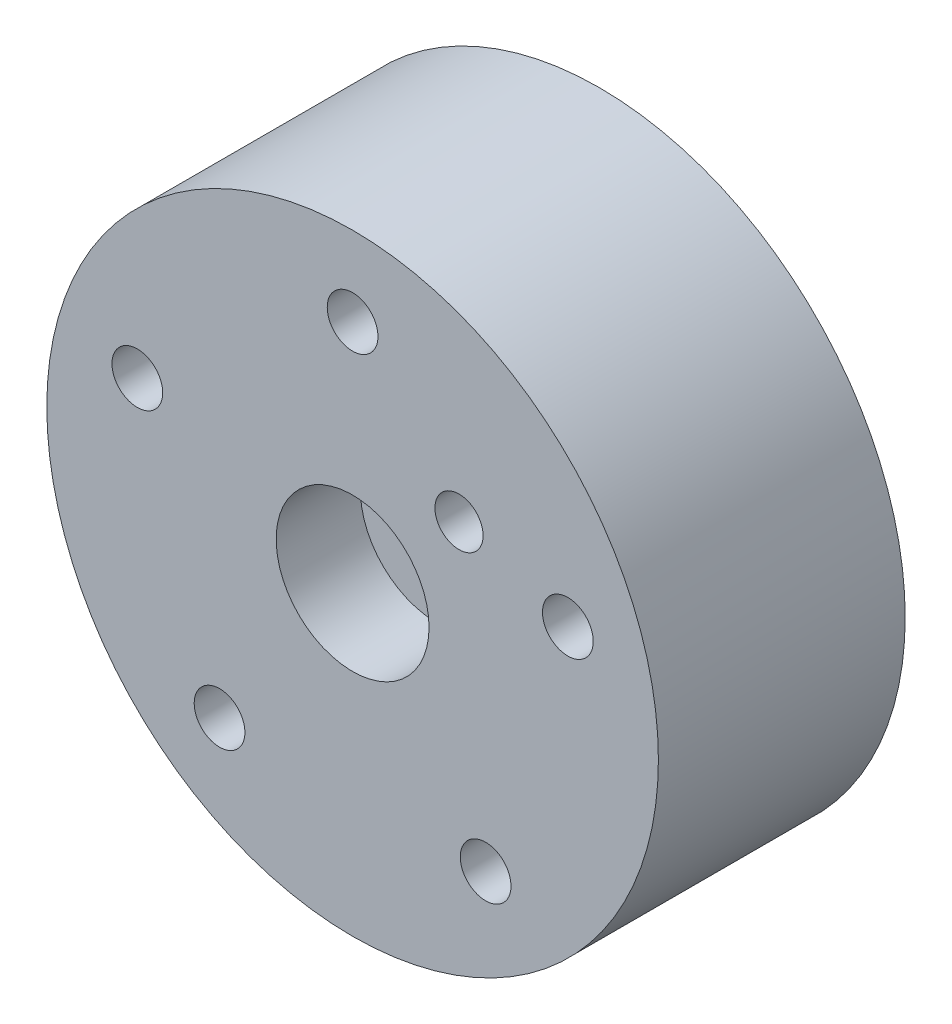
ISO-10303-21;
HEADER;
FILE_DESCRIPTION(('STEP AP214'),'2;1');
FILE_NAME('part.step','',(''),(''),'','','');
FILE_SCHEMA(('AUTOMOTIVE_DESIGN { 1 0 10303 214 1 1 1 1 }'));
ENDSEC;
DATA;
#1=APPLICATION_CONTEXT('core data for automotive mechanical design processes');
#2=APPLICATION_PROTOCOL_DEFINITION('international standard','automotive_design',2000,#1);
#3=PRODUCT_CONTEXT('',#1,'mechanical');
#4=PRODUCT('Part','Part','',(#3));
#5=PRODUCT_RELATED_PRODUCT_CATEGORY('part','',(#4));
#6=PRODUCT_DEFINITION_FORMATION('','',#4);
#7=PRODUCT_DEFINITION_CONTEXT('part definition',#1,'design');
#8=PRODUCT_DEFINITION('design','',#6,#7);
#9=PRODUCT_DEFINITION_SHAPE('','',#8);
#10=(LENGTH_UNIT() NAMED_UNIT(*) SI_UNIT(.MILLI.,.METRE.));
#11=(NAMED_UNIT(*) PLANE_ANGLE_UNIT() SI_UNIT($,.RADIAN.));
#12=(NAMED_UNIT(*) SI_UNIT($,.STERADIAN.) SOLID_ANGLE_UNIT());
#13=UNCERTAINTY_MEASURE_WITH_UNIT(LENGTH_MEASURE(1.E-05),#10,'distance_accuracy_value','');
#14=(GEOMETRIC_REPRESENTATION_CONTEXT(3) GLOBAL_UNCERTAINTY_ASSIGNED_CONTEXT((#13)) GLOBAL_UNIT_ASSIGNED_CONTEXT((#10,
#11,#12)) REPRESENTATION_CONTEXT('',''));
#15=CARTESIAN_POINT('',(0.,0.,0.));
#16=DIRECTION('',(0.,0.,1.));
#17=DIRECTION('',(1.,0.,0.));
#18=AXIS2_PLACEMENT_3D('',#15,#16,#17);
#19=CARTESIAN_POINT('',(0.,0.,41.));
#20=DIRECTION('',(0.,0.,1.));
#21=DIRECTION('',(1.,0.,0.));
#22=AXIS2_PLACEMENT_3D('',#19,#20,#21);
#23=PLANE('',#22);
#24=CARTESIAN_POINT('',(0.,37.6,41.));
#25=DIRECTION('',(0.,0.,-1.));
#26=DIRECTION('',(-1.,0.,0.));
#27=AXIS2_PLACEMENT_3D('',#24,#25,#26);
#28=CIRCLE('',#27,4.21451923647612);
#29=CARTESIAN_POINT('',(-4.21451923647612,37.6,41.));
#30=VERTEX_POINT('',#29);
#31=EDGE_CURVE('E11',#30,#30,#28,.T.);
#32=ORIENTED_EDGE('',*,*,#31,.T.);
#33=EDGE_LOOP('',(#32));
#34=FACE_BOUND('',#33,.T.);
#35=CARTESIAN_POINT('',(35.7597250126965,11.6190389884962,41.));
#36=DIRECTION('',(0.,0.,-1.));
#37=DIRECTION('',(-1.,0.,0.));
#38=AXIS2_PLACEMENT_3D('',#35,#36,#37);
#39=CIRCLE('',#38,4.21451923647612);
#40=CARTESIAN_POINT('',(31.5452057762204,11.6190389884962,41.));
#41=VERTEX_POINT('',#40);
#42=EDGE_CURVE('E49',#41,#41,#39,.T.);
#43=ORIENTED_EDGE('',*,*,#42,.T.);
#44=EDGE_LOOP('',(#43));
#45=FACE_BOUND('',#44,.T.);
#46=CARTESIAN_POINT('',(22.1007254861936,-30.4190389884991,41.));
#47=DIRECTION('',(0.,0.,-1.));
#48=DIRECTION('',(-1.,0.,0.));
#49=AXIS2_PLACEMENT_3D('',#46,#47,#48);
#50=CIRCLE('',#49,4.21451923647612);
#51=CARTESIAN_POINT('',(17.8862062497175,-30.4190389884991,41.));
#52=VERTEX_POINT('',#51);
#53=EDGE_CURVE('E78',#52,#52,#50,.T.);
#54=ORIENTED_EDGE('',*,*,#53,.T.);
#55=EDGE_LOOP('',(#54));
#56=FACE_BOUND('',#55,.T.);
#57=CARTESIAN_POINT('',(-22.1007254862004,-30.4190389884969,41.));
#58=DIRECTION('',(0.,0.,-1.));
#59=DIRECTION('',(-1.,0.,0.));
#60=AXIS2_PLACEMENT_3D('',#57,#58,#59);
#61=CIRCLE('',#60,4.21451923647612);
#62=CARTESIAN_POINT('',(-26.3152447226765,-30.4190389884969,41.));
#63=VERTEX_POINT('',#62);
#64=EDGE_CURVE('E45',#63,#63,#61,.T.);
#65=ORIENTED_EDGE('',*,*,#64,.T.);
#66=EDGE_LOOP('',(#65));
#67=FACE_BOUND('',#66,.T.);
#68=CARTESIAN_POINT('',(-35.7597250126991,11.6190389884998,41.));
#69=DIRECTION('',(0.,0.,-1.));
#70=DIRECTION('',(-1.,0.,0.));
#71=AXIS2_PLACEMENT_3D('',#68,#69,#70);
#72=CIRCLE('',#71,4.21451923647612);
#73=CARTESIAN_POINT('',(-39.9742442491752,11.6190389884998,41.));
#74=VERTEX_POINT('',#73);
#75=EDGE_CURVE('E40',#74,#74,#72,.T.);
#76=ORIENTED_EDGE('',*,*,#75,.T.);
#77=EDGE_LOOP('',(#76));
#78=FACE_BOUND('',#77,.T.);
#79=CARTESIAN_POINT('',(17.6776695296637,17.6776695296637,41.));
#80=DIRECTION('',(0.,0.,1.));
#81=DIRECTION('',(1.,0.,0.));
#82=AXIS2_PLACEMENT_3D('',#79,#80,#81);
#83=CIRCLE('',#82,4.);
#84=CARTESIAN_POINT('',(21.6776695296637,17.6776695296637,41.));
#85=VERTEX_POINT('',#84);
#86=EDGE_CURVE('E200',#85,#85,#83,.T.);
#87=ORIENTED_EDGE('',*,*,#86,.F.);
#88=EDGE_LOOP('',(#87));
#89=FACE_BOUND('',#88,.T.);
#90=CARTESIAN_POINT('',(0.,0.,41.));
#91=DIRECTION('',(0.,0.,1.));
#92=DIRECTION('',(1.,0.,0.));
#93=AXIS2_PLACEMENT_3D('',#90,#91,#92);
#94=CIRCLE('',#93,12.7);
#95=CARTESIAN_POINT('',(12.7,0.,41.));
#96=VERTEX_POINT('',#95);
#97=EDGE_CURVE('E189',#96,#96,#94,.T.);
#98=ORIENTED_EDGE('',*,*,#97,.F.);
#99=EDGE_LOOP('',(#98));
#100=FACE_BOUND('',#99,.T.);
#101=CARTESIAN_POINT('',(0.,0.,41.));
#102=DIRECTION('',(0.,0.,1.));
#103=DIRECTION('',(1.,0.,0.));
#104=AXIS2_PLACEMENT_3D('',#101,#102,#103);
#105=CIRCLE('',#104,50.8);
#106=CARTESIAN_POINT('',(50.8,0.,41.));
#107=VERTEX_POINT('',#106);
#108=EDGE_CURVE('E183',#107,#107,#105,.T.);
#109=ORIENTED_EDGE('',*,*,#108,.T.);
#110=EDGE_LOOP('',(#109));
#111=FACE_BOUND('',#110,.T.);
#112=ADVANCED_FACE('F32',(#34,#45,#56,#67,#78,#89,#100,#111),#23,.T.);
#113=CARTESIAN_POINT('',(0.,0.,0.));
#114=DIRECTION('',(0.,0.,1.));
#115=DIRECTION('',(1.,0.,0.));
#116=AXIS2_PLACEMENT_3D('',#113,#114,#115);
#117=PLANE('',#116);
#118=CARTESIAN_POINT('',(0.,37.6,0.));
#119=DIRECTION('',(0.,0.,-1.));
#120=DIRECTION('',(-1.,0.,0.));
#121=AXIS2_PLACEMENT_3D('',#118,#119,#120);
#122=CIRCLE('',#121,7.);
#123=CARTESIAN_POINT('',(-7.,37.6,0.));
#124=VERTEX_POINT('',#123);
#125=EDGE_CURVE('E66',#124,#124,#122,.T.);
#126=ORIENTED_EDGE('',*,*,#125,.F.);
#127=EDGE_LOOP('',(#126));
#128=FACE_BOUND('',#127,.T.);
#129=CARTESIAN_POINT('',(35.7597250126978,11.619038988498,0.));
#130=DIRECTION('',(0.,0.,-1.));
#131=DIRECTION('',(-1.,0.,0.));
#132=AXIS2_PLACEMENT_3D('',#129,#130,#131);
#133=CIRCLE('',#132,7.);
#134=CARTESIAN_POINT('',(28.7597250126978,11.619038988498,0.));
#135=VERTEX_POINT('',#134);
#136=EDGE_CURVE('E203',#135,#135,#133,.T.);
#137=ORIENTED_EDGE('',*,*,#136,.F.);
#138=EDGE_LOOP('',(#137));
#139=FACE_BOUND('',#138,.T.);
#140=CARTESIAN_POINT('',(22.100725486197,-30.419038988498,0.));
#141=DIRECTION('',(0.,0.,-1.));
#142=DIRECTION('',(-1.,0.,0.));
#143=AXIS2_PLACEMENT_3D('',#140,#141,#142);
#144=CIRCLE('',#143,7.);
#145=CARTESIAN_POINT('',(15.100725486197,-30.419038988498,0.));
#146=VERTEX_POINT('',#145);
#147=EDGE_CURVE('E218',#146,#146,#144,.T.);
#148=ORIENTED_EDGE('',*,*,#147,.F.);
#149=EDGE_LOOP('',(#148));
#150=FACE_BOUND('',#149,.T.);
#151=CARTESIAN_POINT('',(-22.100725486197,-30.419038988498,0.));
#152=DIRECTION('',(0.,0.,-1.));
#153=DIRECTION('',(-1.,0.,0.));
#154=AXIS2_PLACEMENT_3D('',#151,#152,#153);
#155=CIRCLE('',#154,7.);
#156=CARTESIAN_POINT('',(-29.100725486197,-30.419038988498,0.));
#157=VERTEX_POINT('',#156);
#158=EDGE_CURVE('E212',#157,#157,#155,.T.);
#159=ORIENTED_EDGE('',*,*,#158,.F.);
#160=EDGE_LOOP('',(#159));
#161=FACE_BOUND('',#160,.T.);
#162=CARTESIAN_POINT('',(-35.7597250126978,11.619038988498,0.));
#163=DIRECTION('',(0.,0.,-1.));
#164=DIRECTION('',(-1.,0.,0.));
#165=AXIS2_PLACEMENT_3D('',#162,#163,#164);
#166=CIRCLE('',#165,7.);
#167=CARTESIAN_POINT('',(-42.7597250126978,11.619038988498,0.));
#168=VERTEX_POINT('',#167);
#169=EDGE_CURVE('E206',#168,#168,#166,.T.);
#170=ORIENTED_EDGE('',*,*,#169,.F.);
#171=EDGE_LOOP('',(#170));
#172=FACE_BOUND('',#171,.T.);
#173=CARTESIAN_POINT('',(17.6776695296637,17.6776695296637,0.));
#174=DIRECTION('',(0.,0.,-1.));
#175=DIRECTION('',(-1.,0.,0.));
#176=AXIS2_PLACEMENT_3D('',#173,#174,#175);
#177=CIRCLE('',#176,4.);
#178=CARTESIAN_POINT('',(13.6776695296637,17.6776695296637,0.));
#179=VERTEX_POINT('',#178);
#180=EDGE_CURVE('E195',#179,#179,#177,.T.);
#181=ORIENTED_EDGE('',*,*,#180,.F.);
#182=EDGE_LOOP('',(#181));
#183=FACE_BOUND('',#182,.T.);
#184=CARTESIAN_POINT('',(0.,0.,0.));
#185=DIRECTION('',(0.,0.,-1.));
#186=DIRECTION('',(-1.,0.,0.));
#187=AXIS2_PLACEMENT_3D('',#184,#185,#186);
#188=CIRCLE('',#187,50.8);
#189=CARTESIAN_POINT('',(-50.8,0.,0.));
#190=VERTEX_POINT('',#189);
#191=EDGE_CURVE('E186',#190,#190,#188,.T.);
#192=ORIENTED_EDGE('',*,*,#191,.T.);
#193=EDGE_LOOP('',(#192));
#194=FACE_BOUND('',#193,.T.);
#195=ADVANCED_FACE('F34',(#128,#139,#150,#161,#172,#183,#194),#117,.F.);
#196=CARTESIAN_POINT('',(35.7597250126965,11.6190389884962,41.));
#197=DIRECTION('',(0.,0.,-1.));
#198=DIRECTION('',(-1.,0.,0.));
#199=AXIS2_PLACEMENT_3D('',#196,#197,#198);
#200=CYLINDRICAL_SURFACE('',#199,4.21451923647612);
#201=ORIENTED_EDGE('',*,*,#42,.F.);
#202=EDGE_LOOP('',(#201));
#203=FACE_BOUND('',#202,.T.);
#204=CARTESIAN_POINT('',(35.7597250126965,11.6190389884962,35.));
#205=DIRECTION('',(0.,0.,-1.));
#206=DIRECTION('',(-1.,0.,0.));
#207=AXIS2_PLACEMENT_3D('',#204,#205,#206);
#208=CIRCLE('',#207,4.21451923647612);
#209=CARTESIAN_POINT('',(31.5452057762204,11.6190389884962,35.));
#210=VERTEX_POINT('',#209);
#211=EDGE_CURVE('E36',#210,#210,#208,.F.);
#212=ORIENTED_EDGE('',*,*,#211,.F.);
#213=EDGE_LOOP('',(#212));
#214=FACE_BOUND('',#213,.T.);
#215=ADVANCED_FACE('F86',(#203,#214),#200,.F.);
#216=CARTESIAN_POINT('',(22.1007254861936,-30.4190389884991,41.));
#217=DIRECTION('',(0.,0.,-1.));
#218=DIRECTION('',(-1.,0.,0.));
#219=AXIS2_PLACEMENT_3D('',#216,#217,#218);
#220=CYLINDRICAL_SURFACE('',#219,4.21451923647612);
#221=ORIENTED_EDGE('',*,*,#53,.F.);
#222=EDGE_LOOP('',(#221));
#223=FACE_BOUND('',#222,.T.);
#224=CARTESIAN_POINT('',(22.1007254861936,-30.4190389884991,35.));
#225=DIRECTION('',(0.,0.,-1.));
#226=DIRECTION('',(-1.,0.,0.));
#227=AXIS2_PLACEMENT_3D('',#224,#225,#226);
#228=CIRCLE('',#227,4.21451923647612);
#229=CARTESIAN_POINT('',(17.8862062497175,-30.4190389884991,35.));
#230=VERTEX_POINT('',#229);
#231=EDGE_CURVE('E61',#230,#230,#228,.F.);
#232=ORIENTED_EDGE('',*,*,#231,.F.);
#233=EDGE_LOOP('',(#232));
#234=FACE_BOUND('',#233,.T.);
#235=ADVANCED_FACE('F89',(#223,#234),#220,.F.);
#236=CARTESIAN_POINT('',(-22.1007254862004,-30.4190389884969,41.));
#237=DIRECTION('',(0.,0.,-1.));
#238=DIRECTION('',(-1.,0.,0.));
#239=AXIS2_PLACEMENT_3D('',#236,#237,#238);
#240=CYLINDRICAL_SURFACE('',#239,4.21451923647612);
#241=ORIENTED_EDGE('',*,*,#64,.F.);
#242=EDGE_LOOP('',(#241));
#243=FACE_BOUND('',#242,.T.);
#244=CARTESIAN_POINT('',(-22.1007254862004,-30.4190389884969,35.));
#245=DIRECTION('',(0.,0.,-1.));
#246=DIRECTION('',(-1.,0.,0.));
#247=AXIS2_PLACEMENT_3D('',#244,#245,#246);
#248=CIRCLE('',#247,4.21451923647612);
#249=CARTESIAN_POINT('',(-26.3152447226765,-30.4190389884969,35.));
#250=VERTEX_POINT('',#249);
#251=EDGE_CURVE('E58',#250,#250,#248,.F.);
#252=ORIENTED_EDGE('',*,*,#251,.F.);
#253=EDGE_LOOP('',(#252));
#254=FACE_BOUND('',#253,.T.);
#255=ADVANCED_FACE('F95',(#243,#254),#240,.F.);
#256=CARTESIAN_POINT('',(-35.7597250126991,11.6190389884998,41.));
#257=DIRECTION('',(0.,0.,-1.));
#258=DIRECTION('',(-1.,0.,0.));
#259=AXIS2_PLACEMENT_3D('',#256,#257,#258);
#260=CYLINDRICAL_SURFACE('',#259,4.21451923647612);
#261=ORIENTED_EDGE('',*,*,#75,.F.);
#262=EDGE_LOOP('',(#261));
#263=FACE_BOUND('',#262,.T.);
#264=CARTESIAN_POINT('',(-35.7597250126991,11.6190389884998,35.));
#265=DIRECTION('',(0.,0.,-1.));
#266=DIRECTION('',(-1.,0.,0.));
#267=AXIS2_PLACEMENT_3D('',#264,#265,#266);
#268=CIRCLE('',#267,4.21451923647612);
#269=CARTESIAN_POINT('',(-39.9742442491752,11.6190389884998,35.));
#270=VERTEX_POINT('',#269);
#271=EDGE_CURVE('E55',#270,#270,#268,.F.);
#272=ORIENTED_EDGE('',*,*,#271,.F.);
#273=EDGE_LOOP('',(#272));
#274=FACE_BOUND('',#273,.T.);
#275=ADVANCED_FACE('F106',(#263,#274),#260,.F.);
#276=CARTESIAN_POINT('',(0.,37.6,41.));
#277=DIRECTION('',(0.,0.,-1.));
#278=DIRECTION('',(-1.,0.,0.));
#279=AXIS2_PLACEMENT_3D('',#276,#277,#278);
#280=CYLINDRICAL_SURFACE('',#279,4.21451923647612);
#281=ORIENTED_EDGE('',*,*,#31,.F.);
#282=EDGE_LOOP('',(#281));
#283=FACE_BOUND('',#282,.T.);
#284=CARTESIAN_POINT('',(0.,37.6,35.));
#285=DIRECTION('',(0.,0.,-1.));
#286=DIRECTION('',(-1.,0.,0.));
#287=AXIS2_PLACEMENT_3D('',#284,#285,#286);
#288=CIRCLE('',#287,4.21451923647612);
#289=CARTESIAN_POINT('',(-4.21451923647612,37.6,35.));
#290=VERTEX_POINT('',#289);
#291=EDGE_CURVE('E51',#290,#290,#288,.F.);
#292=ORIENTED_EDGE('',*,*,#291,.F.);
#293=EDGE_LOOP('',(#292));
#294=FACE_BOUND('',#293,.T.);
#295=ADVANCED_FACE('F103',(#283,#294),#280,.F.);
#296=CARTESIAN_POINT('',(0.,37.6,35.));
#297=DIRECTION('',(0.,0.,-1.));
#298=DIRECTION('',(-1.,0.,0.));
#299=AXIS2_PLACEMENT_3D('',#296,#297,#298);
#300=PLANE('',#299);
#301=CARTESIAN_POINT('',(0.,37.6,35.));
#302=DIRECTION('',(0.,0.,-1.));
#303=DIRECTION('',(-1.,0.,0.));
#304=AXIS2_PLACEMENT_3D('',#301,#302,#303);
#305=CIRCLE('',#304,7.);
#306=CARTESIAN_POINT('',(-7.,37.6,35.));
#307=VERTEX_POINT('',#306);
#308=EDGE_CURVE('E54',#307,#307,#305,.T.);
#309=ORIENTED_EDGE('',*,*,#308,.T.);
#310=EDGE_LOOP('',(#309));
#311=FACE_BOUND('',#310,.T.);
#312=ORIENTED_EDGE('',*,*,#291,.T.);
#313=EDGE_LOOP('',(#312));
#314=FACE_BOUND('',#313,.T.);
#315=ADVANCED_FACE('F105',(#311,#314),#300,.T.);
#316=CARTESIAN_POINT('',(0.,37.6,35.));
#317=DIRECTION('',(0.,0.,-1.));
#318=DIRECTION('',(-1.,0.,0.));
#319=AXIS2_PLACEMENT_3D('',#316,#317,#318);
#320=CYLINDRICAL_SURFACE('',#319,7.);
#321=ORIENTED_EDGE('',*,*,#308,.F.);
#322=EDGE_LOOP('',(#321));
#323=FACE_BOUND('',#322,.T.);
#324=ORIENTED_EDGE('',*,*,#125,.T.);
#325=EDGE_LOOP('',(#324));
#326=FACE_BOUND('',#325,.T.);
#327=ADVANCED_FACE('F112',(#323,#326),#320,.F.);
#328=CARTESIAN_POINT('',(-35.7597250126978,11.619038988498,35.));
#329=DIRECTION('',(0.,0.,-1.));
#330=DIRECTION('',(-1.,0.,0.));
#331=AXIS2_PLACEMENT_3D('',#328,#329,#330);
#332=PLANE('',#331);
#333=CARTESIAN_POINT('',(-35.7597250126978,11.619038988498,35.));
#334=DIRECTION('',(0.,0.,-1.));
#335=DIRECTION('',(-1.,0.,0.));
#336=AXIS2_PLACEMENT_3D('',#333,#334,#335);
#337=CIRCLE('',#336,7.);
#338=CARTESIAN_POINT('',(-42.7597250126978,11.619038988498,35.));
#339=VERTEX_POINT('',#338);
#340=EDGE_CURVE('E59',#339,#339,#337,.T.);
#341=ORIENTED_EDGE('',*,*,#340,.T.);
#342=EDGE_LOOP('',(#341));
#343=FACE_BOUND('',#342,.T.);
#344=ORIENTED_EDGE('',*,*,#271,.T.);
#345=EDGE_LOOP('',(#344));
#346=FACE_BOUND('',#345,.T.);
#347=ADVANCED_FACE('F129',(#343,#346),#332,.T.);
#348=CARTESIAN_POINT('',(-35.7597250126978,11.619038988498,35.));
#349=DIRECTION('',(0.,0.,-1.));
#350=DIRECTION('',(-1.,0.,0.));
#351=AXIS2_PLACEMENT_3D('',#348,#349,#350);
#352=CYLINDRICAL_SURFACE('',#351,7.);
#353=ORIENTED_EDGE('',*,*,#340,.F.);
#354=EDGE_LOOP('',(#353));
#355=FACE_BOUND('',#354,.T.);
#356=ORIENTED_EDGE('',*,*,#169,.T.);
#357=EDGE_LOOP('',(#356));
#358=FACE_BOUND('',#357,.T.);
#359=ADVANCED_FACE('F156',(#355,#358),#352,.F.);
#360=CARTESIAN_POINT('',(-22.100725486197,-30.419038988498,35.));
#361=DIRECTION('',(0.,0.,-1.));
#362=DIRECTION('',(-1.,0.,0.));
#363=AXIS2_PLACEMENT_3D('',#360,#361,#362);
#364=PLANE('',#363);
#365=CARTESIAN_POINT('',(-22.100725486197,-30.419038988498,35.));
#366=DIRECTION('',(0.,0.,-1.));
#367=DIRECTION('',(-1.,0.,0.));
#368=AXIS2_PLACEMENT_3D('',#365,#366,#367);
#369=CIRCLE('',#368,7.);
#370=CARTESIAN_POINT('',(-29.100725486197,-30.419038988498,35.));
#371=VERTEX_POINT('',#370);
#372=EDGE_CURVE('E209',#371,#371,#369,.T.);
#373=ORIENTED_EDGE('',*,*,#372,.T.);
#374=EDGE_LOOP('',(#373));
#375=FACE_BOUND('',#374,.T.);
#376=ORIENTED_EDGE('',*,*,#251,.T.);
#377=EDGE_LOOP('',(#376));
#378=FACE_BOUND('',#377,.T.);
#379=ADVANCED_FACE('F152',(#375,#378),#364,.T.);
#380=CARTESIAN_POINT('',(-22.100725486197,-30.419038988498,35.));
#381=DIRECTION('',(0.,0.,-1.));
#382=DIRECTION('',(-1.,0.,0.));
#383=AXIS2_PLACEMENT_3D('',#380,#381,#382);
#384=CYLINDRICAL_SURFACE('',#383,7.);
#385=ORIENTED_EDGE('',*,*,#372,.F.);
#386=EDGE_LOOP('',(#385));
#387=FACE_BOUND('',#386,.T.);
#388=ORIENTED_EDGE('',*,*,#158,.T.);
#389=EDGE_LOOP('',(#388));
#390=FACE_BOUND('',#389,.T.);
#391=ADVANCED_FACE('F148',(#387,#390),#384,.F.);
#392=CARTESIAN_POINT('',(22.100725486197,-30.419038988498,35.));
#393=DIRECTION('',(0.,0.,-1.));
#394=DIRECTION('',(-1.,0.,0.));
#395=AXIS2_PLACEMENT_3D('',#392,#393,#394);
#396=PLANE('',#395);
#397=CARTESIAN_POINT('',(22.100725486197,-30.419038988498,35.));
#398=DIRECTION('',(0.,0.,-1.));
#399=DIRECTION('',(-1.,0.,0.));
#400=AXIS2_PLACEMENT_3D('',#397,#398,#399);
#401=CIRCLE('',#400,7.);
#402=CARTESIAN_POINT('',(15.100725486197,-30.419038988498,35.));
#403=VERTEX_POINT('',#402);
#404=EDGE_CURVE('E215',#403,#403,#401,.T.);
#405=ORIENTED_EDGE('',*,*,#404,.T.);
#406=EDGE_LOOP('',(#405));
#407=FACE_BOUND('',#406,.T.);
#408=ORIENTED_EDGE('',*,*,#231,.T.);
#409=EDGE_LOOP('',(#408));
#410=FACE_BOUND('',#409,.T.);
#411=ADVANCED_FACE('F144',(#407,#410),#396,.T.);
#412=CARTESIAN_POINT('',(22.100725486197,-30.419038988498,35.));
#413=DIRECTION('',(0.,0.,-1.));
#414=DIRECTION('',(-1.,0.,0.));
#415=AXIS2_PLACEMENT_3D('',#412,#413,#414);
#416=CYLINDRICAL_SURFACE('',#415,7.);
#417=ORIENTED_EDGE('',*,*,#404,.F.);
#418=EDGE_LOOP('',(#417));
#419=FACE_BOUND('',#418,.T.);
#420=ORIENTED_EDGE('',*,*,#147,.T.);
#421=EDGE_LOOP('',(#420));
#422=FACE_BOUND('',#421,.T.);
#423=ADVANCED_FACE('F140',(#419,#422),#416,.F.);
#424=CARTESIAN_POINT('',(35.7597250126978,11.619038988498,35.));
#425=DIRECTION('',(0.,0.,-1.));
#426=DIRECTION('',(-1.,0.,0.));
#427=AXIS2_PLACEMENT_3D('',#424,#425,#426);
#428=PLANE('',#427);
#429=CARTESIAN_POINT('',(35.7597250126978,11.619038988498,35.));
#430=DIRECTION('',(0.,0.,-1.));
#431=DIRECTION('',(-1.,0.,0.));
#432=AXIS2_PLACEMENT_3D('',#429,#430,#431);
#433=CIRCLE('',#432,7.);
#434=CARTESIAN_POINT('',(28.7597250126978,11.619038988498,35.));
#435=VERTEX_POINT('',#434);
#436=EDGE_CURVE('E221',#435,#435,#433,.T.);
#437=ORIENTED_EDGE('',*,*,#436,.T.);
#438=EDGE_LOOP('',(#437));
#439=FACE_BOUND('',#438,.T.);
#440=ORIENTED_EDGE('',*,*,#211,.T.);
#441=EDGE_LOOP('',(#440));
#442=FACE_BOUND('',#441,.T.);
#443=ADVANCED_FACE('F136',(#439,#442),#428,.T.);
#444=CARTESIAN_POINT('',(35.7597250126978,11.619038988498,35.));
#445=DIRECTION('',(0.,0.,-1.));
#446=DIRECTION('',(-1.,0.,0.));
#447=AXIS2_PLACEMENT_3D('',#444,#445,#446);
#448=CYLINDRICAL_SURFACE('',#447,7.);
#449=ORIENTED_EDGE('',*,*,#436,.F.);
#450=EDGE_LOOP('',(#449));
#451=FACE_BOUND('',#450,.T.);
#452=ORIENTED_EDGE('',*,*,#136,.T.);
#453=EDGE_LOOP('',(#452));
#454=FACE_BOUND('',#453,.T.);
#455=ADVANCED_FACE('F132',(#451,#454),#448,.F.);
#456=CARTESIAN_POINT('',(17.6776695296637,17.6776695296637,55.));
#457=DIRECTION('',(0.,0.,-1.));
#458=DIRECTION('',(-1.,0.,0.));
#459=AXIS2_PLACEMENT_3D('',#456,#457,#458);
#460=CYLINDRICAL_SURFACE('',#459,4.);
#461=ORIENTED_EDGE('',*,*,#86,.T.);
#462=EDGE_LOOP('',(#461));
#463=FACE_BOUND('',#462,.T.);
#464=ORIENTED_EDGE('',*,*,#180,.T.);
#465=EDGE_LOOP('',(#464));
#466=FACE_BOUND('',#465,.T.);
#467=ADVANCED_FACE('F135',(#463,#466),#460,.F.);
#468=CARTESIAN_POINT('',(0.,0.,27.));
#469=DIRECTION('',(0.,0.,1.));
#470=DIRECTION('',(1.,0.,0.));
#471=AXIS2_PLACEMENT_3D('',#468,#469,#470);
#472=CYLINDRICAL_SURFACE('',#471,12.7);
#473=CARTESIAN_POINT('',(0.,0.,27.));
#474=DIRECTION('',(0.,0.,1.));
#475=DIRECTION('',(1.,0.,0.));
#476=AXIS2_PLACEMENT_3D('',#473,#474,#475);
#477=CIRCLE('',#476,12.7);
#478=CARTESIAN_POINT('',(12.7,0.,27.));
#479=VERTEX_POINT('',#478);
#480=EDGE_CURVE('E192',#479,#479,#477,.T.);
#481=ORIENTED_EDGE('',*,*,#480,.F.);
#482=EDGE_LOOP('',(#481));
#483=FACE_BOUND('',#482,.T.);
#484=ORIENTED_EDGE('',*,*,#97,.T.);
#485=EDGE_LOOP('',(#484));
#486=FACE_BOUND('',#485,.T.);
#487=ADVANCED_FACE('F166',(#483,#486),#472,.F.);
#488=CARTESIAN_POINT('',(0.,0.,27.));
#489=DIRECTION('',(0.,0.,1.));
#490=DIRECTION('',(1.,0.,0.));
#491=AXIS2_PLACEMENT_3D('',#488,#489,#490);
#492=PLANE('',#491);
#493=ORIENTED_EDGE('',*,*,#480,.T.);
#494=EDGE_LOOP('',(#493));
#495=FACE_BOUND('',#494,.T.);
#496=ADVANCED_FACE('F170',(#495),#492,.T.);
#497=CARTESIAN_POINT('',(0.,0.,55.));
#498=DIRECTION('',(0.,0.,-1.));
#499=DIRECTION('',(-1.,0.,0.));
#500=AXIS2_PLACEMENT_3D('',#497,#498,#499);
#501=CYLINDRICAL_SURFACE('',#500,50.8);
#502=ORIENTED_EDGE('',*,*,#108,.F.);
#503=EDGE_LOOP('',(#502));
#504=FACE_BOUND('',#503,.T.);
#505=ORIENTED_EDGE('',*,*,#191,.F.);
#506=EDGE_LOOP('',(#505));
#507=FACE_BOUND('',#506,.T.);
#508=ADVANCED_FACE('F174',(#504,#507),#501,.T.);
#509=CLOSED_SHELL('',(#112,#195,#215,#235,#255,#275,#295,#315,#327,#347,#359,#379,#391,#411,
#423,#443,#455,#467,#487,#496,#508));
#510=MANIFOLD_SOLID_BREP('B2',#509);
#511=ADVANCED_BREP_SHAPE_REPRESENTATION('',(#18,#510),#14);
#512=SHAPE_DEFINITION_REPRESENTATION(#9,#511);
ENDSEC;
END-ISO-10303-21;
